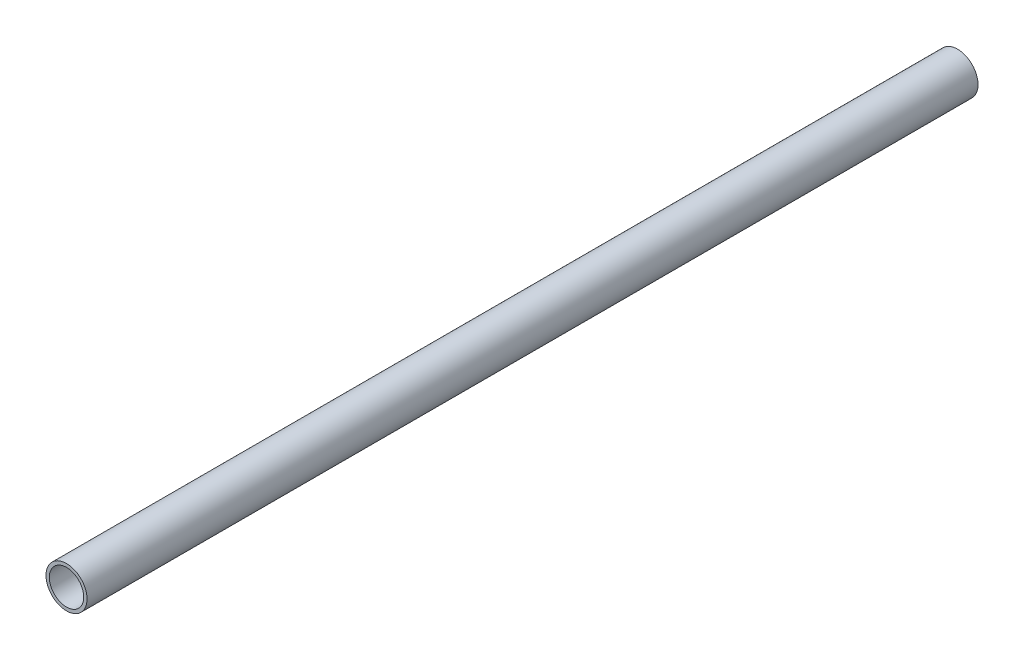
ISO-10303-21;
HEADER;
FILE_DESCRIPTION(('STEP AP214'),'2;1');
FILE_NAME('part.step','',(''),(''),'','','');
FILE_SCHEMA(('AUTOMOTIVE_DESIGN { 1 0 10303 214 1 1 1 1 }'));
ENDSEC;
DATA;
#1=APPLICATION_CONTEXT('core data for automotive mechanical design processes');
#2=APPLICATION_PROTOCOL_DEFINITION('international standard','automotive_design',2000,#1);
#3=PRODUCT_CONTEXT('',#1,'mechanical');
#4=PRODUCT('Part','Part','',(#3));
#5=PRODUCT_RELATED_PRODUCT_CATEGORY('part','',(#4));
#6=PRODUCT_DEFINITION_FORMATION('','',#4);
#7=PRODUCT_DEFINITION_CONTEXT('part definition',#1,'design');
#8=PRODUCT_DEFINITION('design','',#6,#7);
#9=PRODUCT_DEFINITION_SHAPE('','',#8);
#10=(LENGTH_UNIT() NAMED_UNIT(*) SI_UNIT(.MILLI.,.METRE.));
#11=(NAMED_UNIT(*) PLANE_ANGLE_UNIT() SI_UNIT($,.RADIAN.));
#12=(NAMED_UNIT(*) SI_UNIT($,.STERADIAN.) SOLID_ANGLE_UNIT());
#13=UNCERTAINTY_MEASURE_WITH_UNIT(LENGTH_MEASURE(1.E-05),#10,'distance_accuracy_value','');
#14=(GEOMETRIC_REPRESENTATION_CONTEXT(3) GLOBAL_UNCERTAINTY_ASSIGNED_CONTEXT((#13)) GLOBAL_UNIT_ASSIGNED_CONTEXT((#10,
#11,#12)) REPRESENTATION_CONTEXT('',''));
#15=CARTESIAN_POINT('',(0.,0.,0.));
#16=DIRECTION('',(0.,0.,1.));
#17=DIRECTION('',(1.,0.,0.));
#18=AXIS2_PLACEMENT_3D('',#15,#16,#17);
#19=CARTESIAN_POINT('',(0.,0.,361.187771899508));
#20=DIRECTION('',(0.,0.,-1.));
#21=DIRECTION('',(-1.,0.,0.));
#22=AXIS2_PLACEMENT_3D('',#19,#20,#21);
#23=CYLINDRICAL_SURFACE('',#22,8.35);
#24=CARTESIAN_POINT('',(0.,0.,337.570405407877));
#25=DIRECTION('',(0.,0.,1.));
#26=DIRECTION('',(0.,-1.,0.));
#27=AXIS2_PLACEMENT_3D('',#24,#25,#26);
#28=CIRCLE('',#27,8.35);
#29=CARTESIAN_POINT('',(0.,-8.35,337.570405407877));
#30=VERTEX_POINT('',#29);
#31=EDGE_CURVE('E10',#30,#30,#28,.T.);
#32=ORIENTED_EDGE('',*,*,#31,.F.);
#33=EDGE_LOOP('',(#32));
#34=FACE_BOUND('',#33,.T.);
#35=CARTESIAN_POINT('',(0.,0.,-25.0000000000005));
#36=DIRECTION('',(0.,0.,-1.));
#37=DIRECTION('',(-1.,0.,0.));
#38=AXIS2_PLACEMENT_3D('',#35,#36,#37);
#39=CIRCLE('',#38,8.35);
#40=CARTESIAN_POINT('',(-8.35,0.,-25.0000000000005));
#41=VERTEX_POINT('',#40);
#42=EDGE_CURVE('E46',#41,#41,#39,.F.);
#43=ORIENTED_EDGE('',*,*,#42,.T.);
#44=EDGE_LOOP('',(#43));
#45=FACE_BOUND('',#44,.T.);
#46=ADVANCED_FACE('F32',(#34,#45),#23,.T.);
#47=CARTESIAN_POINT('',(0.,0.,361.187771899508));
#48=DIRECTION('',(0.,0.,-1.));
#49=DIRECTION('',(-1.,0.,0.));
#50=AXIS2_PLACEMENT_3D('',#47,#48,#49);
#51=CYLINDRICAL_SURFACE('',#50,7.);
#52=CARTESIAN_POINT('',(0.,0.,337.570405407877));
#53=DIRECTION('',(0.,0.,1.));
#54=DIRECTION('',(0.,-1.,0.));
#55=AXIS2_PLACEMENT_3D('',#52,#53,#54);
#56=CIRCLE('',#55,7.);
#57=CARTESIAN_POINT('',(0.,-7.,337.570405407877));
#58=VERTEX_POINT('',#57);
#59=EDGE_CURVE('E35',#58,#58,#56,.T.);
#60=ORIENTED_EDGE('',*,*,#59,.T.);
#61=EDGE_LOOP('',(#60));
#62=FACE_BOUND('',#61,.T.);
#63=CARTESIAN_POINT('',(0.,0.,-25.0000000000005));
#64=DIRECTION('',(0.,0.,-1.));
#65=DIRECTION('',(-1.,0.,0.));
#66=AXIS2_PLACEMENT_3D('',#63,#64,#65);
#67=CIRCLE('',#66,7.);
#68=CARTESIAN_POINT('',(-7.,0.,-25.0000000000005));
#69=VERTEX_POINT('',#68);
#70=EDGE_CURVE('E42',#69,#69,#67,.F.);
#71=ORIENTED_EDGE('',*,*,#70,.F.);
#72=EDGE_LOOP('',(#71));
#73=FACE_BOUND('',#72,.T.);
#74=ADVANCED_FACE('F58',(#62,#73),#51,.F.);
#75=CARTESIAN_POINT('',(-1.66514283539458,-10.2702141867434,337.570405407877));
#76=DIRECTION('',(0.,0.,1.));
#77=DIRECTION('',(-0.438499500818347,0.898731432510325,0.));
#78=AXIS2_PLACEMENT_3D('',#75,#76,#77);
#79=PLANE('',#78);
#80=ORIENTED_EDGE('',*,*,#59,.F.);
#81=EDGE_LOOP('',(#80));
#82=FACE_BOUND('',#81,.T.);
#83=ORIENTED_EDGE('',*,*,#31,.T.);
#84=EDGE_LOOP('',(#83));
#85=FACE_BOUND('',#84,.T.);
#86=ADVANCED_FACE('F54',(#82,#85),#79,.T.);
#87=CARTESIAN_POINT('',(-6.34615301533191,0.221002049748399,-25.0000000000005));
#88=DIRECTION('',(0.,0.,-1.));
#89=DIRECTION('',(-0.0348034724013225,-0.999394175642829,0.));
#90=AXIS2_PLACEMENT_3D('',#87,#88,#89);
#91=PLANE('',#90);
#92=ORIENTED_EDGE('',*,*,#42,.F.);
#93=EDGE_LOOP('',(#92));
#94=FACE_BOUND('',#93,.T.);
#95=ORIENTED_EDGE('',*,*,#70,.T.);
#96=EDGE_LOOP('',(#95));
#97=FACE_BOUND('',#96,.T.);
#98=ADVANCED_FACE('F51',(#94,#97),#91,.T.);
#99=CLOSED_SHELL('',(#46,#74,#86,#98));
#100=MANIFOLD_SOLID_BREP('B2',#99);
#101=ADVANCED_BREP_SHAPE_REPRESENTATION('',(#18,#100),#14);
#102=SHAPE_DEFINITION_REPRESENTATION(#9,#101);
ENDSEC;
END-ISO-10303-21;
